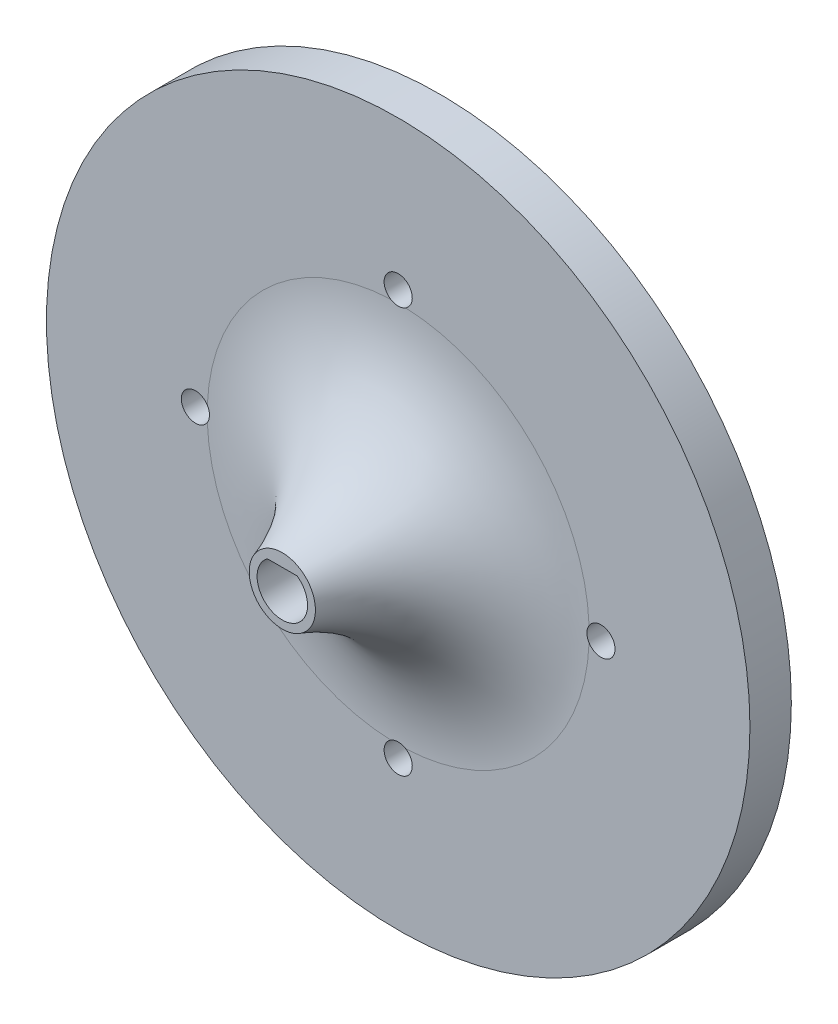
ISO-10303-21;
HEADER;
FILE_DESCRIPTION(('STEP AP214'),'2;1');
FILE_NAME('part.step','',(''),(''),'','','');
FILE_SCHEMA(('AUTOMOTIVE_DESIGN { 1 0 10303 214 1 1 1 1 }'));
ENDSEC;
DATA;
#1=APPLICATION_CONTEXT('core data for automotive mechanical design processes');
#2=APPLICATION_PROTOCOL_DEFINITION('international standard','automotive_design',2000,#1);
#3=PRODUCT_CONTEXT('',#1,'mechanical');
#4=PRODUCT('Part','Part','',(#3));
#5=PRODUCT_RELATED_PRODUCT_CATEGORY('part','',(#4));
#6=PRODUCT_DEFINITION_FORMATION('','',#4);
#7=PRODUCT_DEFINITION_CONTEXT('part definition',#1,'design');
#8=PRODUCT_DEFINITION('design','',#6,#7);
#9=PRODUCT_DEFINITION_SHAPE('','',#8);
#10=(LENGTH_UNIT() NAMED_UNIT(*) SI_UNIT(.MILLI.,.METRE.));
#11=(NAMED_UNIT(*) PLANE_ANGLE_UNIT() SI_UNIT($,.RADIAN.));
#12=(NAMED_UNIT(*) SI_UNIT($,.STERADIAN.) SOLID_ANGLE_UNIT());
#13=UNCERTAINTY_MEASURE_WITH_UNIT(LENGTH_MEASURE(1.E-05),#10,'distance_accuracy_value','');
#14=(GEOMETRIC_REPRESENTATION_CONTEXT(3) GLOBAL_UNCERTAINTY_ASSIGNED_CONTEXT((#13)) GLOBAL_UNIT_ASSIGNED_CONTEXT((#10,
#11,#12)) REPRESENTATION_CONTEXT('',''));
#15=CARTESIAN_POINT('',(0.,0.,0.));
#16=DIRECTION('',(0.,0.,1.));
#17=DIRECTION('',(1.,0.,0.));
#18=AXIS2_PLACEMENT_3D('',#15,#16,#17);
#19=CARTESIAN_POINT('',(0.,0.,5.));
#20=DIRECTION('',(0.,0.,-1.));
#21=DIRECTION('',(-1.,0.,0.));
#22=AXIS2_PLACEMENT_3D('',#19,#20,#21);
#23=PLANE('',#22);
#24=CARTESIAN_POINT('',(24.5,-8.5,5.));
#25=DIRECTION('',(0.,0.,-1.));
#26=DIRECTION('',(-1.,0.,0.));
#27=AXIS2_PLACEMENT_3D('',#24,#25,#26);
#28=CIRCLE('',#27,1.7);
#29=CARTESIAN_POINT('',(23.0610259638104,-7.59481840320725,5.));
#30=VERTEX_POINT('',#29);
#31=CARTESIAN_POINT('',(23.0610259638104,-9.40518159679275,5.));
#32=VERTEX_POINT('',#31);
#33=EDGE_CURVE('E134',#30,#32,#28,.T.);
#34=ORIENTED_EDGE('',*,*,#33,.T.);
#35=CARTESIAN_POINT('',(0.,-8.5,5.));
#36=DIRECTION('',(0.,0.,-1.));
#37=DIRECTION('',(-1.,0.,0.));
#38=AXIS2_PLACEMENT_3D('',#35,#36,#37);
#39=CIRCLE('',#38,23.0787840283389);
#40=CARTESIAN_POINT('',(0.905181596792745,-31.5610259638104,5.));
#41=VERTEX_POINT('',#40);
#42=EDGE_CURVE('E185',#32,#41,#39,.T.);
#43=ORIENTED_EDGE('',*,*,#42,.T.);
#44=CARTESIAN_POINT('',(0.,-33.,5.));
#45=DIRECTION('',(0.,0.,-1.));
#46=DIRECTION('',(-1.,0.,0.));
#47=AXIS2_PLACEMENT_3D('',#44,#45,#46);
#48=CIRCLE('',#47,1.7);
#49=CARTESIAN_POINT('',(-0.905181596792749,-31.5610259638104,5.));
#50=VERTEX_POINT('',#49);
#51=EDGE_CURVE('E122',#41,#50,#48,.T.);
#52=ORIENTED_EDGE('',*,*,#51,.T.);
#53=CARTESIAN_POINT('',(0.,-8.5,5.));
#54=DIRECTION('',(0.,0.,-1.));
#55=DIRECTION('',(-1.,0.,0.));
#56=AXIS2_PLACEMENT_3D('',#53,#54,#55);
#57=CIRCLE('',#56,23.0787840283389);
#58=CARTESIAN_POINT('',(-23.0610259638104,-9.40518159679275,5.));
#59=VERTEX_POINT('',#58);
#60=EDGE_CURVE('E183',#50,#59,#57,.T.);
#61=ORIENTED_EDGE('',*,*,#60,.T.);
#62=CARTESIAN_POINT('',(-24.5,-8.5,5.));
#63=DIRECTION('',(0.,0.,-1.));
#64=DIRECTION('',(-1.,0.,0.));
#65=AXIS2_PLACEMENT_3D('',#62,#63,#64);
#66=CIRCLE('',#65,1.7);
#67=CARTESIAN_POINT('',(-23.0610259638104,-7.59481840320725,5.));
#68=VERTEX_POINT('',#67);
#69=EDGE_CURVE('E140',#59,#68,#66,.T.);
#70=ORIENTED_EDGE('',*,*,#69,.T.);
#71=CARTESIAN_POINT('',(0.,-8.5,5.));
#72=DIRECTION('',(0.,0.,-1.));
#73=DIRECTION('',(-1.,0.,0.));
#74=AXIS2_PLACEMENT_3D('',#71,#72,#73);
#75=CIRCLE('',#74,23.0787840283389);
#76=CARTESIAN_POINT('',(-0.905181596792753,14.5610259638104,5.));
#77=VERTEX_POINT('',#76);
#78=EDGE_CURVE('E181',#68,#77,#75,.T.);
#79=ORIENTED_EDGE('',*,*,#78,.T.);
#80=CARTESIAN_POINT('',(0.,16.,5.));
#81=DIRECTION('',(0.,0.,-1.));
#82=DIRECTION('',(-1.,0.,0.));
#83=AXIS2_PLACEMENT_3D('',#80,#81,#82);
#84=CIRCLE('',#83,1.7);
#85=CARTESIAN_POINT('',(0.905181596792749,14.5610259638104,5.));
#86=VERTEX_POINT('',#85);
#87=EDGE_CURVE('E124',#77,#86,#84,.T.);
#88=ORIENTED_EDGE('',*,*,#87,.T.);
#89=CARTESIAN_POINT('',(0.,-8.5,5.));
#90=DIRECTION('',(0.,0.,-1.));
#91=DIRECTION('',(-1.,0.,0.));
#92=AXIS2_PLACEMENT_3D('',#89,#90,#91);
#93=CIRCLE('',#92,23.0787840283389);
#94=EDGE_CURVE('E179',#86,#30,#93,.T.);
#95=ORIENTED_EDGE('',*,*,#94,.T.);
#96=EDGE_LOOP('',(#34,#43,#52,#61,#70,#79,#88,#95));
#97=FACE_BOUND('',#96,.T.);
#98=CARTESIAN_POINT('',(0.,-8.5,5.));
#99=DIRECTION('',(0.,0.,1.));
#100=DIRECTION('',(1.,0.,0.));
#101=AXIS2_PLACEMENT_3D('',#98,#99,#100);
#102=CIRCLE('',#101,42.5);
#103=CARTESIAN_POINT('',(42.5,-8.5,5.));
#104=VERTEX_POINT('',#103);
#105=EDGE_CURVE('E168',#104,#104,#102,.T.);
#106=ORIENTED_EDGE('',*,*,#105,.T.);
#107=EDGE_LOOP('',(#106));
#108=FACE_BOUND('',#107,.T.);
#109=ADVANCED_FACE('F41',(#97,#108),#23,.F.);
#110=CARTESIAN_POINT('',(0.,0.,0.));
#111=DIRECTION('',(0.,0.,-1.));
#112=DIRECTION('',(-1.,0.,0.));
#113=AXIS2_PLACEMENT_3D('',#110,#111,#112);
#114=PLANE('',#113);
#115=CARTESIAN_POINT('',(24.5,-8.5,0.));
#116=DIRECTION('',(0.,0.,-1.));
#117=DIRECTION('',(-1.,0.,0.));
#118=AXIS2_PLACEMENT_3D('',#115,#116,#117);
#119=CIRCLE('',#118,16.);
#120=CARTESIAN_POINT('',(8.50000000000001,-8.5,0.));
#121=VERTEX_POINT('',#120);
#122=EDGE_CURVE('E153',#121,#121,#119,.T.);
#123=ORIENTED_EDGE('',*,*,#122,.F.);
#124=EDGE_LOOP('',(#123));
#125=FACE_BOUND('',#124,.T.);
#126=CARTESIAN_POINT('',(0.,-33.,0.));
#127=DIRECTION('',(0.,0.,-1.));
#128=DIRECTION('',(1.,0.,0.));
#129=AXIS2_PLACEMENT_3D('',#126,#127,#128);
#130=CIRCLE('',#129,16.);
#131=CARTESIAN_POINT('',(16.,-33.,0.));
#132=VERTEX_POINT('',#131);
#133=EDGE_CURVE('E159',#132,#132,#130,.T.);
#134=ORIENTED_EDGE('',*,*,#133,.F.);
#135=EDGE_LOOP('',(#134));
#136=FACE_BOUND('',#135,.T.);
#137=CARTESIAN_POINT('',(-24.5,-8.5,0.));
#138=DIRECTION('',(0.,0.,-1.));
#139=DIRECTION('',(1.,0.,0.));
#140=AXIS2_PLACEMENT_3D('',#137,#138,#139);
#141=CIRCLE('',#140,16.);
#142=CARTESIAN_POINT('',(-8.50000000000001,-8.5,0.));
#143=VERTEX_POINT('',#142);
#144=EDGE_CURVE('E147',#143,#143,#141,.T.);
#145=ORIENTED_EDGE('',*,*,#144,.F.);
#146=EDGE_LOOP('',(#145));
#147=FACE_BOUND('',#146,.T.);
#148=CARTESIAN_POINT('',(0.,16.,0.));
#149=DIRECTION('',(0.,0.,-1.));
#150=DIRECTION('',(-1.,0.,0.));
#151=AXIS2_PLACEMENT_3D('',#148,#149,#150);
#152=CIRCLE('',#151,16.);
#153=CARTESIAN_POINT('',(-16.,16.,0.));
#154=VERTEX_POINT('',#153);
#155=EDGE_CURVE('E162',#154,#154,#152,.T.);
#156=ORIENTED_EDGE('',*,*,#155,.F.);
#157=EDGE_LOOP('',(#156));
#158=FACE_BOUND('',#157,.T.);
#159=CARTESIAN_POINT('',(0.,-8.5,0.));
#160=DIRECTION('',(0.,0.,1.));
#161=DIRECTION('',(1.,0.,0.));
#162=AXIS2_PLACEMENT_3D('',#159,#160,#161);
#163=CIRCLE('',#162,42.5);
#164=CARTESIAN_POINT('',(42.5,-8.5,0.));
#165=VERTEX_POINT('',#164);
#166=EDGE_CURVE('E171',#165,#165,#163,.T.);
#167=ORIENTED_EDGE('',*,*,#166,.F.);
#168=EDGE_LOOP('',(#167));
#169=FACE_BOUND('',#168,.T.);
#170=ADVANCED_FACE('F245',(#125,#136,#147,#158,#169),#114,.T.);
#171=CARTESIAN_POINT('',(0.,-8.5,19.));
#172=DIRECTION('',(0.,0.,1.));
#173=DIRECTION('',(1.,0.,0.));
#174=AXIS2_PLACEMENT_3D('',#171,#172,#173);
#175=PLANE('',#174);
#176=CARTESIAN_POINT('',(0.,-8.5,19.));
#177=DIRECTION('',(0.,0.,1.));
#178=DIRECTION('',(1.,0.,0.));
#179=AXIS2_PLACEMENT_3D('',#176,#177,#178);
#180=CIRCLE('',#179,3.05);
#181=CARTESIAN_POINT('',(-1.80302523554164,-6.04,19.));
#182=VERTEX_POINT('',#181);
#183=CARTESIAN_POINT('',(1.80302523554164,-6.04,19.));
#184=VERTEX_POINT('',#183);
#185=EDGE_CURVE('E105',#182,#184,#180,.T.);
#186=ORIENTED_EDGE('',*,*,#185,.F.);
#187=DIRECTION('',(-1.,0.,0.));
#188=VECTOR('',#187,1.);
#189=CARTESIAN_POINT('',(1.80302523554164,-6.04,19.));
#190=LINE('',#189,#188);
#191=EDGE_CURVE('E115',#184,#182,#190,.T.);
#192=ORIENTED_EDGE('',*,*,#191,.F.);
#193=EDGE_LOOP('',(#186,#192));
#194=FACE_BOUND('',#193,.T.);
#195=CARTESIAN_POINT('',(0.,-8.5,19.));
#196=DIRECTION('',(0.,0.,1.));
#197=DIRECTION('',(1.,0.,0.));
#198=AXIS2_PLACEMENT_3D('',#195,#196,#197);
#199=CIRCLE('',#198,4.);
#200=CARTESIAN_POINT('',(4.,-8.5,19.));
#201=VERTEX_POINT('',#200);
#202=EDGE_CURVE('E174',#201,#201,#199,.T.);
#203=ORIENTED_EDGE('',*,*,#202,.T.);
#204=EDGE_LOOP('',(#203));
#205=FACE_BOUND('',#204,.T.);
#206=ADVANCED_FACE('F241',(#194,#205),#175,.T.);
#207=CARTESIAN_POINT('',(0.,-8.5,0.));
#208=DIRECTION('',(0.,0.,1.));
#209=DIRECTION('',(1.,0.,0.));
#210=AXIS2_PLACEMENT_3D('',#207,#208,#209);
#211=CYLINDRICAL_SURFACE('',#210,42.5);
#212=ORIENTED_EDGE('',*,*,#166,.T.);
#213=EDGE_LOOP('',(#212));
#214=FACE_BOUND('',#213,.T.);
#215=ORIENTED_EDGE('',*,*,#105,.F.);
#216=EDGE_LOOP('',(#215));
#217=FACE_BOUND('',#216,.T.);
#218=ADVANCED_FACE('F237',(#214,#217),#211,.T.);
#219=CARTESIAN_POINT('',(0.,16.,2.5));
#220=DIRECTION('',(0.,0.,-1.));
#221=DIRECTION('',(-1.,0.,0.));
#222=AXIS2_PLACEMENT_3D('',#219,#220,#221);
#223=CYLINDRICAL_SURFACE('',#222,16.);
#224=CARTESIAN_POINT('',(0.,16.,2.5));
#225=DIRECTION('',(0.,0.,-1.));
#226=DIRECTION('',(-1.,0.,0.));
#227=AXIS2_PLACEMENT_3D('',#224,#225,#226);
#228=CIRCLE('',#227,16.);
#229=CARTESIAN_POINT('',(-16.,16.,2.5));
#230=VERTEX_POINT('',#229);
#231=EDGE_CURVE('E165',#230,#230,#228,.T.);
#232=ORIENTED_EDGE('',*,*,#231,.F.);
#233=EDGE_LOOP('',(#232));
#234=FACE_BOUND('',#233,.T.);
#235=ORIENTED_EDGE('',*,*,#155,.T.);
#236=EDGE_LOOP('',(#235));
#237=FACE_BOUND('',#236,.T.);
#238=ADVANCED_FACE('F233',(#234,#237),#223,.F.);
#239=CARTESIAN_POINT('',(0.,16.,2.5));
#240=DIRECTION('',(0.,0.,-1.));
#241=DIRECTION('',(-1.,0.,0.));
#242=AXIS2_PLACEMENT_3D('',#239,#240,#241);
#243=PLANE('',#242);
#244=CARTESIAN_POINT('',(0.,16.,2.5));
#245=DIRECTION('',(0.,0.,-1.));
#246=DIRECTION('',(-1.,0.,0.));
#247=AXIS2_PLACEMENT_3D('',#244,#245,#246);
#248=CIRCLE('',#247,1.7);
#249=CARTESIAN_POINT('',(-1.7,16.,2.5));
#250=VERTEX_POINT('',#249);
#251=EDGE_CURVE('E128',#250,#250,#248,.T.);
#252=ORIENTED_EDGE('',*,*,#251,.F.);
#253=EDGE_LOOP('',(#252));
#254=FACE_BOUND('',#253,.T.);
#255=ORIENTED_EDGE('',*,*,#231,.T.);
#256=EDGE_LOOP('',(#255));
#257=FACE_BOUND('',#256,.T.);
#258=ADVANCED_FACE('F210',(#254,#257),#243,.T.);
#259=CARTESIAN_POINT('',(-24.5,-8.5,2.5));
#260=DIRECTION('',(0.,0.,-1.));
#261=DIRECTION('',(-1.,0.,0.));
#262=AXIS2_PLACEMENT_3D('',#259,#260,#261);
#263=CYLINDRICAL_SURFACE('',#262,16.);
#264=CARTESIAN_POINT('',(-24.5,-8.5,2.5));
#265=DIRECTION('',(0.,0.,-1.));
#266=DIRECTION('',(1.,0.,0.));
#267=AXIS2_PLACEMENT_3D('',#264,#265,#266);
#268=CIRCLE('',#267,16.);
#269=CARTESIAN_POINT('',(-8.50000000000001,-8.5,2.5));
#270=VERTEX_POINT('',#269);
#271=EDGE_CURVE('E127',#270,#270,#268,.T.);
#272=ORIENTED_EDGE('',*,*,#271,.F.);
#273=EDGE_LOOP('',(#272));
#274=FACE_BOUND('',#273,.T.);
#275=ORIENTED_EDGE('',*,*,#144,.T.);
#276=EDGE_LOOP('',(#275));
#277=FACE_BOUND('',#276,.T.);
#278=ADVANCED_FACE('F206',(#274,#277),#263,.F.);
#279=CARTESIAN_POINT('',(-24.5,-8.5,2.5));
#280=DIRECTION('',(0.,0.,1.));
#281=DIRECTION('',(1.,0.,0.));
#282=AXIS2_PLACEMENT_3D('',#279,#280,#281);
#283=PLANE('',#282);
#284=CARTESIAN_POINT('',(-24.5,-8.5,2.5));
#285=DIRECTION('',(0.,0.,-1.));
#286=DIRECTION('',(-1.,0.,0.));
#287=AXIS2_PLACEMENT_3D('',#284,#285,#286);
#288=CIRCLE('',#287,1.7);
#289=CARTESIAN_POINT('',(-26.2,-8.5,2.5));
#290=VERTEX_POINT('',#289);
#291=EDGE_CURVE('E137',#290,#290,#288,.T.);
#292=ORIENTED_EDGE('',*,*,#291,.F.);
#293=EDGE_LOOP('',(#292));
#294=FACE_BOUND('',#293,.T.);
#295=ORIENTED_EDGE('',*,*,#271,.T.);
#296=EDGE_LOOP('',(#295));
#297=FACE_BOUND('',#296,.T.);
#298=ADVANCED_FACE('F209',(#294,#297),#283,.F.);
#299=CARTESIAN_POINT('',(0.,-33.,2.5));
#300=DIRECTION('',(0.,0.,-1.));
#301=DIRECTION('',(-1.,0.,0.));
#302=AXIS2_PLACEMENT_3D('',#299,#300,#301);
#303=CYLINDRICAL_SURFACE('',#302,16.);
#304=CARTESIAN_POINT('',(0.,-33.,2.5));
#305=DIRECTION('',(0.,0.,-1.));
#306=DIRECTION('',(1.,0.,0.));
#307=AXIS2_PLACEMENT_3D('',#304,#305,#306);
#308=CIRCLE('',#307,16.);
#309=CARTESIAN_POINT('',(16.,-33.,2.5));
#310=VERTEX_POINT('',#309);
#311=EDGE_CURVE('E156',#310,#310,#308,.T.);
#312=ORIENTED_EDGE('',*,*,#311,.F.);
#313=EDGE_LOOP('',(#312));
#314=FACE_BOUND('',#313,.T.);
#315=ORIENTED_EDGE('',*,*,#133,.T.);
#316=EDGE_LOOP('',(#315));
#317=FACE_BOUND('',#316,.T.);
#318=ADVANCED_FACE('F214',(#314,#317),#303,.F.);
#319=CARTESIAN_POINT('',(0.,-33.,2.5));
#320=DIRECTION('',(0.,0.,1.));
#321=DIRECTION('',(1.,0.,0.));
#322=AXIS2_PLACEMENT_3D('',#319,#320,#321);
#323=PLANE('',#322);
#324=CARTESIAN_POINT('',(0.,-33.,2.5));
#325=DIRECTION('',(0.,0.,-1.));
#326=DIRECTION('',(-1.,0.,0.));
#327=AXIS2_PLACEMENT_3D('',#324,#325,#326);
#328=CIRCLE('',#327,1.7);
#329=CARTESIAN_POINT('',(-1.7,-33.,2.5));
#330=VERTEX_POINT('',#329);
#331=EDGE_CURVE('E143',#330,#330,#328,.T.);
#332=ORIENTED_EDGE('',*,*,#331,.F.);
#333=EDGE_LOOP('',(#332));
#334=FACE_BOUND('',#333,.T.);
#335=ORIENTED_EDGE('',*,*,#311,.T.);
#336=EDGE_LOOP('',(#335));
#337=FACE_BOUND('',#336,.T.);
#338=ADVANCED_FACE('F220',(#334,#337),#323,.F.);
#339=CARTESIAN_POINT('',(24.5,-8.5,2.5));
#340=DIRECTION('',(0.,0.,-1.));
#341=DIRECTION('',(-1.,0.,0.));
#342=AXIS2_PLACEMENT_3D('',#339,#340,#341);
#343=CYLINDRICAL_SURFACE('',#342,16.);
#344=CARTESIAN_POINT('',(24.5,-8.5,2.5));
#345=DIRECTION('',(0.,0.,-1.));
#346=DIRECTION('',(-1.,0.,0.));
#347=AXIS2_PLACEMENT_3D('',#344,#345,#346);
#348=CIRCLE('',#347,16.);
#349=CARTESIAN_POINT('',(8.50000000000001,-8.5,2.5));
#350=VERTEX_POINT('',#349);
#351=EDGE_CURVE('E150',#350,#350,#348,.T.);
#352=ORIENTED_EDGE('',*,*,#351,.F.);
#353=EDGE_LOOP('',(#352));
#354=FACE_BOUND('',#353,.T.);
#355=ORIENTED_EDGE('',*,*,#122,.T.);
#356=EDGE_LOOP('',(#355));
#357=FACE_BOUND('',#356,.T.);
#358=ADVANCED_FACE('F216',(#354,#357),#343,.F.);
#359=CARTESIAN_POINT('',(24.5,-8.5,2.5));
#360=DIRECTION('',(0.,0.,-1.));
#361=DIRECTION('',(-1.,0.,0.));
#362=AXIS2_PLACEMENT_3D('',#359,#360,#361);
#363=PLANE('',#362);
#364=CARTESIAN_POINT('',(24.5,-8.5,2.5));
#365=DIRECTION('',(0.,0.,-1.));
#366=DIRECTION('',(-1.,0.,0.));
#367=AXIS2_PLACEMENT_3D('',#364,#365,#366);
#368=CIRCLE('',#367,1.7);
#369=CARTESIAN_POINT('',(22.8,-8.5,2.5));
#370=VERTEX_POINT('',#369);
#371=EDGE_CURVE('E131',#370,#370,#368,.T.);
#372=ORIENTED_EDGE('',*,*,#371,.F.);
#373=EDGE_LOOP('',(#372));
#374=FACE_BOUND('',#373,.T.);
#375=ORIENTED_EDGE('',*,*,#351,.T.);
#376=EDGE_LOOP('',(#375));
#377=FACE_BOUND('',#376,.T.);
#378=ADVANCED_FACE('F219',(#374,#377),#363,.T.);
#379=CARTESIAN_POINT('',(24.5,-8.5,5.));
#380=DIRECTION('',(0.,0.,-1.));
#381=DIRECTION('',(-1.,0.,0.));
#382=AXIS2_PLACEMENT_3D('',#379,#380,#381);
#383=CYLINDRICAL_SURFACE('',#382,1.7);
#384=ORIENTED_EDGE('',*,*,#33,.F.);
#385=CARTESIAN_POINT('',(23.0610259638104,-7.59481840320725,5.));
#386=CARTESIAN_POINT('',(23.0355576074221,-7.63530629235898,5.00000038897516));
#387=CARTESIAN_POINT('',(23.0118107730211,-7.67684991539034,5.00005474049753));
#388=CARTESIAN_POINT('',(22.967900355707,-7.76178685529984,5.00023161259283));
#389=CARTESIAN_POINT('',(22.9477366022187,-7.80518008400416,5.00035412991953));
#390=CARTESIAN_POINT('',(22.892893276267,-7.93758714199864,5.00076381662639));
#391=CARTESIAN_POINT('',(22.8637682310674,-8.02897716606578,5.00109341083501));
#392=CARTESIAN_POINT('',(22.8212749168449,-8.21533699942863,5.00162434029869));
#393=CARTESIAN_POINT('',(22.8079126805825,-8.31030816496213,5.001825626434));
#394=CARTESIAN_POINT('',(22.7973173111084,-8.50118032868895,5.00198264221536));
#395=CARTESIAN_POINT('',(22.8000871487309,-8.59708149490184,5.0019383266322));
#396=CARTESIAN_POINT('',(22.8216864134641,-8.78708792959496,5.0016286461412));
#397=CARTESIAN_POINT('',(22.8405241911134,-8.88119223824116,5.00136316629555));
#398=CARTESIAN_POINT('',(22.8937390001605,-9.06483268566849,5.00077439029535));
#399=CARTESIAN_POINT('',(22.9280949999092,-9.15437482532125,5.00045117274922));
#400=CARTESIAN_POINT('',(22.9833555171567,-9.26862586069275,5.00016534483193));
#401=CARTESIAN_POINT('',(22.9978419914131,-9.29656380411851,5.00010623811065));
#402=CARTESIAN_POINT('',(23.028315455002,-9.35154434769084,5.00002358845399));
#403=CARTESIAN_POINT('',(23.0442997380816,-9.37858844761169,4.99999998264297));
#404=CARTESIAN_POINT('',(23.0610259638104,-9.40518159679275,5.));
#405=B_SPLINE_CURVE_WITH_KNOTS('',3,(#385,#386,#387,#388,#389,#390,#391,#392,#393,#394,#395,
#396,#397,#398,#399,#400,#401,#402,#403,#404),.UNSPECIFIED.,.F.,.F.,(4,2,2,2,2,2,2,2,2,4),(0.,
0.143407872865978,0.286808916867436,0.573090590285553,0.859481794247178,1.14592574082077,
1.43251864361615,1.71872429074512,1.81310078261906,1.90730992667383),.UNSPECIFIED.);
#406=EDGE_CURVE('E11',#30,#32,#405,.T.);
#407=ORIENTED_EDGE('',*,*,#406,.T.);
#408=EDGE_LOOP('',(#384,#407));
#409=FACE_BOUND('',#408,.T.);
#410=ORIENTED_EDGE('',*,*,#371,.T.);
#411=EDGE_LOOP('',(#410));
#412=FACE_BOUND('',#411,.T.);
#413=ADVANCED_FACE('F204',(#409,#412),#383,.F.);
#414=CARTESIAN_POINT('',(0.,-33.,5.));
#415=DIRECTION('',(0.,0.,-1.));
#416=DIRECTION('',(-1.,0.,0.));
#417=AXIS2_PLACEMENT_3D('',#414,#415,#416);
#418=CYLINDRICAL_SURFACE('',#417,1.7);
#419=ORIENTED_EDGE('',*,*,#51,.F.);
#420=CARTESIAN_POINT('',(0.905181596792745,-31.5610259638104,5.));
#421=CARTESIAN_POINT('',(0.864693707641011,-31.5355576074221,5.00000038897516));
#422=CARTESIAN_POINT('',(0.823150084609653,-31.5118107730211,5.00005474049753));
#423=CARTESIAN_POINT('',(0.738213144700163,-31.467900355707,5.00023161259283));
#424=CARTESIAN_POINT('',(0.694819915995835,-31.4477366022187,5.00035412991953));
#425=CARTESIAN_POINT('',(0.562412858001358,-31.392893276267,5.00076381662639));
#426=CARTESIAN_POINT('',(0.471022833934217,-31.3637682310674,5.00109341083501));
#427=CARTESIAN_POINT('',(0.284663000571368,-31.3212749168449,5.00162434029869));
#428=CARTESIAN_POINT('',(0.189691835037868,-31.3079126805825,5.001825626434));
#429=CARTESIAN_POINT('',(-0.00118032868895299,-31.2973173111084,5.00198264221536));
#430=CARTESIAN_POINT('',(-0.0970814949018417,-31.3000871487309,5.0019383266322));
#431=CARTESIAN_POINT('',(-0.287087929594962,-31.3216864134641,5.0016286461412));
#432=CARTESIAN_POINT('',(-0.381192238241161,-31.3405241911134,5.00136316629554));
#433=CARTESIAN_POINT('',(-0.564832685668497,-31.3937390001605,5.00077439029535));
#434=CARTESIAN_POINT('',(-0.654374825321252,-31.4280949999092,5.00045117274922));
#435=CARTESIAN_POINT('',(-0.768625860692751,-31.4833555171567,5.00016534483193));
#436=CARTESIAN_POINT('',(-0.796563804118512,-31.4978419914131,5.00010623811065));
#437=CARTESIAN_POINT('',(-0.851544347690837,-31.528315455002,5.00002358845399));
#438=CARTESIAN_POINT('',(-0.878588447611693,-31.5442997380816,4.99999998264297));
#439=CARTESIAN_POINT('',(-0.90518159679275,-31.5610259638104,5.));
#440=B_SPLINE_CURVE_WITH_KNOTS('',3,(#420,#421,#422,#423,#424,#425,#426,#427,#428,#429,#430,
#431,#432,#433,#434,#435,#436,#437,#438,#439),.UNSPECIFIED.,.F.,.F.,(4,2,2,2,2,2,2,2,2,4),(0.,
0.143407872865973,0.286808916867434,0.573090590285548,0.859481794247171,1.14592574082076,
1.43251864361614,1.71872429074512,1.81310078261905,1.90730992667382),.UNSPECIFIED.);
#441=EDGE_CURVE('E62',#41,#50,#440,.T.);
#442=ORIENTED_EDGE('',*,*,#441,.T.);
#443=EDGE_LOOP('',(#419,#442));
#444=FACE_BOUND('',#443,.T.);
#445=ORIENTED_EDGE('',*,*,#331,.T.);
#446=EDGE_LOOP('',(#445));
#447=FACE_BOUND('',#446,.T.);
#448=ADVANCED_FACE('F199',(#444,#447),#418,.F.);
#449=CARTESIAN_POINT('',(-24.5,-8.5,5.));
#450=DIRECTION('',(0.,0.,-1.));
#451=DIRECTION('',(-1.,0.,0.));
#452=AXIS2_PLACEMENT_3D('',#449,#450,#451);
#453=CYLINDRICAL_SURFACE('',#452,1.7);
#454=ORIENTED_EDGE('',*,*,#69,.F.);
#455=CARTESIAN_POINT('',(-23.0610259638104,-9.40518159679275,5.));
#456=CARTESIAN_POINT('',(-23.0355576074221,-9.36469370764102,5.00000038897516));
#457=CARTESIAN_POINT('',(-23.0118107730211,-9.32315008460966,5.00005474049753));
#458=CARTESIAN_POINT('',(-22.967900355707,-9.23821314470016,5.00023161259283));
#459=CARTESIAN_POINT('',(-22.9477366022187,-9.19481991599584,5.00035412991953));
#460=CARTESIAN_POINT('',(-22.892893276267,-9.06241285800136,5.00076381662639));
#461=CARTESIAN_POINT('',(-22.8637682310674,-8.97102283393422,5.00109341083501));
#462=CARTESIAN_POINT('',(-22.8212749168449,-8.78466300057137,5.00162434029869));
#463=CARTESIAN_POINT('',(-22.8079126805825,-8.68969183503787,5.001825626434));
#464=CARTESIAN_POINT('',(-22.7973173111084,-8.49881967131105,5.00198264221535));
#465=CARTESIAN_POINT('',(-22.8000871487309,-8.40291850509816,5.0019383266322));
#466=CARTESIAN_POINT('',(-22.8216864134641,-8.21291207040504,5.0016286461412));
#467=CARTESIAN_POINT('',(-22.8405241911134,-8.11880776175884,5.00136316629555));
#468=CARTESIAN_POINT('',(-22.8937390001605,-7.93516731433151,5.00077439029535));
#469=CARTESIAN_POINT('',(-22.9280949999092,-7.84562517467875,5.00045117274922));
#470=CARTESIAN_POINT('',(-22.9833555171567,-7.73137413930725,5.00016534483193));
#471=CARTESIAN_POINT('',(-22.9978419914131,-7.70343619588149,5.00010623811065));
#472=CARTESIAN_POINT('',(-23.028315455002,-7.64845565230916,5.00002358845399));
#473=CARTESIAN_POINT('',(-23.0442997380816,-7.62141155238831,4.99999998264297));
#474=CARTESIAN_POINT('',(-23.0610259638104,-7.59481840320725,5.));
#475=B_SPLINE_CURVE_WITH_KNOTS('',3,(#455,#456,#457,#458,#459,#460,#461,#462,#463,#464,#465,
#466,#467,#468,#469,#470,#471,#472,#473,#474),.UNSPECIFIED.,.F.,.F.,(4,2,2,2,2,2,2,2,2,4),(0.,
0.143407872865978,0.286808916867436,0.573090590285553,0.859481794247178,1.14592574082077,
1.43251864361615,1.71872429074512,1.81310078261905,1.90730992667383),.UNSPECIFIED.);
#476=EDGE_CURVE('E193',#59,#68,#475,.T.);
#477=ORIENTED_EDGE('',*,*,#476,.T.);
#478=EDGE_LOOP('',(#454,#477));
#479=FACE_BOUND('',#478,.T.);
#480=ORIENTED_EDGE('',*,*,#291,.T.);
#481=EDGE_LOOP('',(#480));
#482=FACE_BOUND('',#481,.T.);
#483=ADVANCED_FACE('F203',(#479,#482),#453,.F.);
#484=CARTESIAN_POINT('',(0.,16.,5.));
#485=DIRECTION('',(0.,0.,-1.));
#486=DIRECTION('',(-1.,0.,0.));
#487=AXIS2_PLACEMENT_3D('',#484,#485,#486);
#488=CYLINDRICAL_SURFACE('',#487,1.7);
#489=ORIENTED_EDGE('',*,*,#87,.F.);
#490=CARTESIAN_POINT('',(-0.905181596792753,14.5610259638104,5.));
#491=CARTESIAN_POINT('',(-0.864693707641019,14.5355576074221,5.00000038897516));
#492=CARTESIAN_POINT('',(-0.82315008460966,14.5118107730211,5.00005474049753));
#493=CARTESIAN_POINT('',(-0.738213144700168,14.467900355707,5.00023161259283));
#494=CARTESIAN_POINT('',(-0.694819915995841,14.4477366022187,5.00035412991953));
#495=CARTESIAN_POINT('',(-0.562412858001364,14.392893276267,5.00076381662639));
#496=CARTESIAN_POINT('',(-0.471022833934223,14.3637682310674,5.00109341083501));
#497=CARTESIAN_POINT('',(-0.284663000571375,14.3212749168449,5.00162434029869));
#498=CARTESIAN_POINT('',(-0.189691835037874,14.3079126805825,5.001825626434));
#499=CARTESIAN_POINT('',(0.00118032868894734,14.2973173111084,5.00198264221536));
#500=CARTESIAN_POINT('',(0.0970814949018365,14.3000871487309,5.0019383266322));
#501=CARTESIAN_POINT('',(0.287087929594956,14.3216864134641,5.0016286461412));
#502=CARTESIAN_POINT('',(0.381192238241155,14.3405241911134,5.00136316629555));
#503=CARTESIAN_POINT('',(0.56483268566849,14.3937390001605,5.00077439029535));
#504=CARTESIAN_POINT('',(0.654374825321246,14.4280949999092,5.00045117274922));
#505=CARTESIAN_POINT('',(0.768625860692745,14.4833555171567,5.00016534483193));
#506=CARTESIAN_POINT('',(0.796563804118507,14.4978419914131,5.00010623811065));
#507=CARTESIAN_POINT('',(0.851544347690834,14.528315455002,5.00002358845399));
#508=CARTESIAN_POINT('',(0.87858844761169,14.5442997380816,4.99999998264297));
#509=CARTESIAN_POINT('',(0.905181596792749,14.5610259638104,5.));
#510=B_SPLINE_CURVE_WITH_KNOTS('',3,(#490,#491,#492,#493,#494,#495,#496,#497,#498,#499,#500,
#501,#502,#503,#504,#505,#506,#507,#508,#509),.UNSPECIFIED.,.F.,.F.,(4,2,2,2,2,2,2,2,2,4),(0.,
0.143407872865977,0.286808916867436,0.573090590285551,0.859481794247174,1.14592574082077,
1.43251864361615,1.71872429074512,1.81310078261906,1.90730992667383),.UNSPECIFIED.);
#511=EDGE_CURVE('E55',#77,#86,#510,.T.);
#512=ORIENTED_EDGE('',*,*,#511,.T.);
#513=EDGE_LOOP('',(#489,#512));
#514=FACE_BOUND('',#513,.T.);
#515=ORIENTED_EDGE('',*,*,#251,.T.);
#516=EDGE_LOOP('',(#515));
#517=FACE_BOUND('',#516,.T.);
#518=ADVANCED_FACE('F329',(#514,#517),#488,.F.);
#519=CARTESIAN_POINT('',(0.,-8.5,5.));
#520=DIRECTION('',(0.,0.,1.));
#521=DIRECTION('',(1.,0.,0.));
#522=AXIS2_PLACEMENT_3D('',#519,#520,#521);
#523=CYLINDRICAL_SURFACE('',#522,3.05);
#524=ORIENTED_EDGE('',*,*,#185,.T.);
#525=DIRECTION('',(0.,0.,1.));
#526=VECTOR('',#525,1.);
#527=CARTESIAN_POINT('',(1.80302523554164,-6.04,5.));
#528=LINE('',#527,#526);
#529=CARTESIAN_POINT('',(1.80302523554164,-6.04,5.));
#530=VERTEX_POINT('',#529);
#531=EDGE_CURVE('E99',#530,#184,#528,.T.);
#532=ORIENTED_EDGE('',*,*,#531,.F.);
#533=CARTESIAN_POINT('',(0.,-8.5,5.));
#534=DIRECTION('',(0.,0.,1.));
#535=DIRECTION('',(1.,0.,0.));
#536=AXIS2_PLACEMENT_3D('',#533,#534,#535);
#537=CIRCLE('',#536,3.05);
#538=CARTESIAN_POINT('',(-1.80302523554164,-6.04,5.));
#539=VERTEX_POINT('',#538);
#540=EDGE_CURVE('E102',#539,#530,#537,.T.);
#541=ORIENTED_EDGE('',*,*,#540,.F.);
#542=DIRECTION('',(0.,0.,1.));
#543=VECTOR('',#542,1.);
#544=CARTESIAN_POINT('',(-1.80302523554164,-6.04,5.));
#545=LINE('',#544,#543);
#546=EDGE_CURVE('E110',#539,#182,#545,.T.);
#547=ORIENTED_EDGE('',*,*,#546,.T.);
#548=EDGE_LOOP('',(#524,#532,#541,#547));
#549=FACE_BOUND('',#548,.T.);
#550=ADVANCED_FACE('F101',(#549),#523,.F.);
#551=CARTESIAN_POINT('',(1.80302523554164,-6.04,5.));
#552=DIRECTION('',(0.,1.,0.));
#553=DIRECTION('',(0.,0.,1.));
#554=AXIS2_PLACEMENT_3D('',#551,#552,#553);
#555=PLANE('',#554);
#556=ORIENTED_EDGE('',*,*,#191,.T.);
#557=ORIENTED_EDGE('',*,*,#546,.F.);
#558=DIRECTION('',(-1.,0.,0.));
#559=VECTOR('',#558,1.);
#560=CARTESIAN_POINT('',(1.80302523554164,-6.04,5.));
#561=LINE('',#560,#559);
#562=EDGE_CURVE('E111',#530,#539,#561,.T.);
#563=ORIENTED_EDGE('',*,*,#562,.F.);
#564=ORIENTED_EDGE('',*,*,#531,.T.);
#565=EDGE_LOOP('',(#556,#557,#563,#564));
#566=FACE_BOUND('',#565,.T.);
#567=ADVANCED_FACE('F117',(#566),#555,.F.);
#568=CARTESIAN_POINT('',(0.,-8.5,5.));
#569=DIRECTION('',(0.,0.,1.));
#570=DIRECTION('',(1.,0.,0.));
#571=AXIS2_PLACEMENT_3D('',#568,#569,#570);
#572=PLANE('',#571);
#573=ORIENTED_EDGE('',*,*,#540,.T.);
#574=ORIENTED_EDGE('',*,*,#562,.T.);
#575=EDGE_LOOP('',(#573,#574));
#576=FACE_BOUND('',#575,.T.);
#577=ADVANCED_FACE('F114',(#576),#572,.T.);
#578=CARTESIAN_POINT('',(0.,-8.5,25.));
#579=DIRECTION('',(0.,0.,-1.));
#580=DIRECTION('',(-1.,0.,0.));
#581=AXIS2_PLACEMENT_3D('',#578,#579,#580);
#582=TOROIDAL_SURFACE('',#581,23.0787840283389,20.);
#583=ORIENTED_EDGE('',*,*,#441,.F.);
#584=ORIENTED_EDGE('',*,*,#42,.F.);
#585=ORIENTED_EDGE('',*,*,#406,.F.);
#586=ORIENTED_EDGE('',*,*,#94,.F.);
#587=ORIENTED_EDGE('',*,*,#511,.F.);
#588=ORIENTED_EDGE('',*,*,#78,.F.);
#589=ORIENTED_EDGE('',*,*,#476,.F.);
#590=ORIENTED_EDGE('',*,*,#60,.F.);
#591=EDGE_LOOP('',(#583,#584,#585,#586,#587,#588,#589,#590));
#592=FACE_BOUND('',#591,.T.);
#593=ORIENTED_EDGE('',*,*,#202,.F.);
#594=EDGE_LOOP('',(#593));
#595=FACE_BOUND('',#594,.T.);
#596=ADVANCED_FACE('F43',(#592,#595),#582,.F.);
#597=CLOSED_SHELL('',(#109,#170,#206,#218,#238,#258,#278,#298,#318,#338,#358,#378,#413,#448,
#483,#518,#550,#567,#577,#596));
#598=MANIFOLD_SOLID_BREP('B2',#597);
#599=ADVANCED_BREP_SHAPE_REPRESENTATION('',(#18,#598),#14);
#600=SHAPE_DEFINITION_REPRESENTATION(#9,#599);
ENDSEC;
END-ISO-10303-21;
